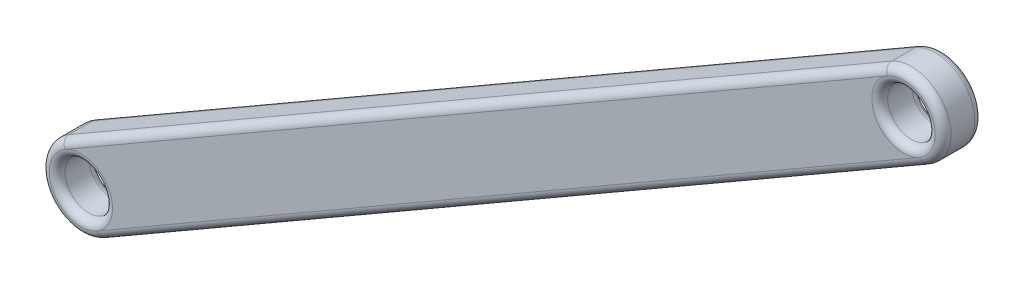
ISO-10303-21;
HEADER;
FILE_DESCRIPTION(('STEP AP214'),'2;1');
FILE_NAME('part.step','',(''),(''),'','','');
FILE_SCHEMA(('AUTOMOTIVE_DESIGN { 1 0 10303 214 1 1 1 1 }'));
ENDSEC;
DATA;
#1=APPLICATION_CONTEXT('core data for automotive mechanical design processes');
#2=APPLICATION_PROTOCOL_DEFINITION('international standard','automotive_design',2000,#1);
#3=PRODUCT_CONTEXT('',#1,'mechanical');
#4=PRODUCT('Part','Part','',(#3));
#5=PRODUCT_RELATED_PRODUCT_CATEGORY('part','',(#4));
#6=PRODUCT_DEFINITION_FORMATION('','',#4);
#7=PRODUCT_DEFINITION_CONTEXT('part definition',#1,'design');
#8=PRODUCT_DEFINITION('design','',#6,#7);
#9=PRODUCT_DEFINITION_SHAPE('','',#8);
#10=(LENGTH_UNIT() NAMED_UNIT(*) SI_UNIT(.MILLI.,.METRE.));
#11=(NAMED_UNIT(*) PLANE_ANGLE_UNIT() SI_UNIT($,.RADIAN.));
#12=(NAMED_UNIT(*) SI_UNIT($,.STERADIAN.) SOLID_ANGLE_UNIT());
#13=UNCERTAINTY_MEASURE_WITH_UNIT(LENGTH_MEASURE(1.E-05),#10,'distance_accuracy_value','');
#14=(GEOMETRIC_REPRESENTATION_CONTEXT(3) GLOBAL_UNCERTAINTY_ASSIGNED_CONTEXT((#13)) GLOBAL_UNIT_ASSIGNED_CONTEXT((#10,
#11,#12)) REPRESENTATION_CONTEXT('',''));
#15=CARTESIAN_POINT('',(0.,0.,0.));
#16=DIRECTION('',(0.,0.,1.));
#17=DIRECTION('',(1.,0.,0.));
#18=AXIS2_PLACEMENT_3D('',#15,#16,#17);
#19=CARTESIAN_POINT('',(0.,0.,2.5));
#20=DIRECTION('',(0.,0.,1.));
#21=DIRECTION('',(1.,0.,0.));
#22=AXIS2_PLACEMENT_3D('',#19,#20,#21);
#23=PLANE('',#22);
#24=CARTESIAN_POINT('',(0.,0.,2.5));
#25=DIRECTION('',(0.,0.,1.));
#26=DIRECTION('',(1.,0.,0.));
#27=AXIS2_PLACEMENT_3D('',#24,#25,#26);
#28=CIRCLE('',#27,2.);
#29=CARTESIAN_POINT('',(-1.00000000000001,1.73205080756887,2.5));
#30=VERTEX_POINT('',#29);
#31=CARTESIAN_POINT('',(2.,0.,2.5));
#32=VERTEX_POINT('',#31);
#33=EDGE_CURVE('E50',#30,#32,#28,.F.);
#34=ORIENTED_EDGE('',*,*,#33,.T.);
#35=CARTESIAN_POINT('',(0.,0.,2.5));
#36=DIRECTION('',(0.,0.,1.));
#37=DIRECTION('',(1.,0.,0.));
#38=AXIS2_PLACEMENT_3D('',#35,#36,#37);
#39=CIRCLE('',#38,2.);
#40=CARTESIAN_POINT('',(1.00000000000001,-1.73205080756887,2.5));
#41=VERTEX_POINT('',#40);
#42=EDGE_CURVE('E11',#32,#41,#39,.F.);
#43=ORIENTED_EDGE('',*,*,#42,.T.);
#44=DIRECTION('',(0.866025403784436,0.500000000000004,0.));
#45=VECTOR('',#44,1.);
#46=CARTESIAN_POINT('',(52.9615242270662,28.2679491924314,2.5));
#47=LINE('',#46,#45);
#48=CARTESIAN_POINT('',(52.9615242270662,28.2679491924314,2.5));
#49=VERTEX_POINT('',#48);
#50=EDGE_CURVE('E181',#41,#49,#47,.T.);
#51=ORIENTED_EDGE('',*,*,#50,.T.);
#52=CARTESIAN_POINT('',(51.9615242270662,30.0000000000003,2.5));
#53=DIRECTION('',(0.,0.,1.));
#54=DIRECTION('',(1.,0.,0.));
#55=AXIS2_PLACEMENT_3D('',#52,#53,#54);
#56=CIRCLE('',#55,2.00000000000001);
#57=CARTESIAN_POINT('',(50.9615242270661,31.7320508075691,2.5));
#58=VERTEX_POINT('',#57);
#59=EDGE_CURVE('E179',#49,#58,#56,.F.);
#60=ORIENTED_EDGE('',*,*,#59,.T.);
#61=DIRECTION('',(-0.866025403784436,-0.500000000000004,0.));
#62=VECTOR('',#61,1.);
#63=CARTESIAN_POINT('',(-1.00000000000001,1.73205080756887,2.5));
#64=LINE('',#63,#62);
#65=EDGE_CURVE('E61',#58,#30,#64,.T.);
#66=ORIENTED_EDGE('',*,*,#65,.T.);
#67=EDGE_LOOP('',(#34,#43,#51,#60,#66));
#68=FACE_BOUND('',#67,.T.);
#69=ADVANCED_FACE('F41',(#68),#23,.T.);
#70=CARTESIAN_POINT('',(0.,0.,0.));
#71=DIRECTION('',(0.,0.,1.));
#72=DIRECTION('',(1.,0.,0.));
#73=AXIS2_PLACEMENT_3D('',#70,#71,#72);
#74=PLANE('',#73);
#75=DIRECTION('',(0.866025403784436,0.500000000000004,0.));
#76=VECTOR('',#75,1.);
#77=CARTESIAN_POINT('',(1.00000000000001,-1.73205080756887,0.));
#78=LINE('',#77,#76);
#79=CARTESIAN_POINT('',(52.9615242270662,28.2679491924314,0.));
#80=VERTEX_POINT('',#79);
#81=CARTESIAN_POINT('',(1.00000000000001,-1.73205080756887,0.));
#82=VERTEX_POINT('',#81);
#83=EDGE_CURVE('E144',#80,#82,#78,.F.);
#84=ORIENTED_EDGE('',*,*,#83,.T.);
#85=CARTESIAN_POINT('',(0.,0.,0.));
#86=DIRECTION('',(0.,0.,1.));
#87=DIRECTION('',(1.,0.,0.));
#88=AXIS2_PLACEMENT_3D('',#85,#86,#87);
#89=CIRCLE('',#88,2.);
#90=CARTESIAN_POINT('',(2.,0.,0.));
#91=VERTEX_POINT('',#90);
#92=EDGE_CURVE('E118',#82,#91,#89,.T.);
#93=ORIENTED_EDGE('',*,*,#92,.T.);
#94=CARTESIAN_POINT('',(0.,0.,0.));
#95=DIRECTION('',(0.,0.,1.));
#96=DIRECTION('',(1.,0.,0.));
#97=AXIS2_PLACEMENT_3D('',#94,#95,#96);
#98=CIRCLE('',#97,2.);
#99=CARTESIAN_POINT('',(-1.00000000000001,1.73205080756888,0.));
#100=VERTEX_POINT('',#99);
#101=EDGE_CURVE('E117',#91,#100,#98,.T.);
#102=ORIENTED_EDGE('',*,*,#101,.T.);
#103=DIRECTION('',(-0.866025403784436,-0.500000000000004,0.));
#104=VECTOR('',#103,1.);
#105=CARTESIAN_POINT('',(-1.00000000000001,1.73205080756888,0.));
#106=LINE('',#105,#104);
#107=CARTESIAN_POINT('',(50.9615242270661,31.7320508075691,0.));
#108=VERTEX_POINT('',#107);
#109=EDGE_CURVE('E134',#100,#108,#106,.F.);
#110=ORIENTED_EDGE('',*,*,#109,.T.);
#111=CARTESIAN_POINT('',(51.9615242270662,30.0000000000003,0.));
#112=DIRECTION('',(0.,0.,1.));
#113=DIRECTION('',(1.,0.,0.));
#114=AXIS2_PLACEMENT_3D('',#111,#112,#113);
#115=CIRCLE('',#114,2.00000000000001);
#116=EDGE_CURVE('E140',#108,#80,#115,.T.);
#117=ORIENTED_EDGE('',*,*,#116,.T.);
#118=EDGE_LOOP('',(#84,#93,#102,#110,#117));
#119=FACE_BOUND('',#118,.T.);
#120=ADVANCED_FACE('F143',(#119),#74,.F.);
#121=CARTESIAN_POINT('',(0.,0.,2.5));
#122=DIRECTION('',(0.,0.,-1.));
#123=DIRECTION('',(-1.,0.,0.));
#124=AXIS2_PLACEMENT_3D('',#121,#122,#123);
#125=CYLINDRICAL_SURFACE('',#124,2.5);
#126=DIRECTION('',(0.,0.,-1.));
#127=VECTOR('',#126,1.);
#128=CARTESIAN_POINT('',(-1.25000000000001,2.16506350946109,2.5));
#129=LINE('',#128,#127);
#130=CARTESIAN_POINT('',(-1.25000000000001,2.16506350946109,2.));
#131=VERTEX_POINT('',#130);
#132=CARTESIAN_POINT('',(-1.25000000000001,2.16506350946109,0.5));
#133=VERTEX_POINT('',#132);
#134=EDGE_CURVE('E191',#131,#133,#129,.T.);
#135=ORIENTED_EDGE('',*,*,#134,.T.);
#136=CARTESIAN_POINT('',(0.,0.,0.5));
#137=DIRECTION('',(0.,0.,1.));
#138=DIRECTION('',(1.,0.,0.));
#139=AXIS2_PLACEMENT_3D('',#136,#137,#138);
#140=CIRCLE('',#139,2.5);
#141=CARTESIAN_POINT('',(1.25000000000001,-2.16506350946109,0.5));
#142=VERTEX_POINT('',#141);
#143=EDGE_CURVE('E128',#133,#142,#140,.T.);
#144=ORIENTED_EDGE('',*,*,#143,.T.);
#145=DIRECTION('',(0.,0.,-1.));
#146=VECTOR('',#145,1.);
#147=CARTESIAN_POINT('',(1.25000000000001,-2.16506350946109,2.5));
#148=LINE('',#147,#146);
#149=CARTESIAN_POINT('',(1.25000000000001,-2.16506350946109,2.));
#150=VERTEX_POINT('',#149);
#151=EDGE_CURVE('E141',#150,#142,#148,.T.);
#152=ORIENTED_EDGE('',*,*,#151,.F.);
#153=CARTESIAN_POINT('',(0.,0.,2.));
#154=DIRECTION('',(0.,0.,1.));
#155=DIRECTION('',(1.,0.,0.));
#156=AXIS2_PLACEMENT_3D('',#153,#154,#155);
#157=CIRCLE('',#156,2.5);
#158=EDGE_CURVE('E176',#150,#131,#157,.F.);
#159=ORIENTED_EDGE('',*,*,#158,.T.);
#160=EDGE_LOOP('',(#135,#144,#152,#159));
#161=FACE_BOUND('',#160,.T.);
#162=ADVANCED_FACE('F225',(#161),#125,.T.);
#163=CARTESIAN_POINT('',(1.25000000000001,-2.16506350946109,2.5));
#164=DIRECTION('',(-0.500000000000004,0.866025403784436,0.));
#165=DIRECTION('',(-0.866025403784436,-0.500000000000004,0.));
#166=AXIS2_PLACEMENT_3D('',#163,#164,#165);
#167=PLANE('',#166);
#168=ORIENTED_EDGE('',*,*,#151,.T.);
#169=DIRECTION('',(0.866025403784436,0.500000000000004,0.));
#170=VECTOR('',#169,1.);
#171=CARTESIAN_POINT('',(1.25000000000001,-2.16506350946109,0.5));
#172=LINE('',#171,#170);
#173=CARTESIAN_POINT('',(53.2115242270662,27.8349364905391,0.5));
#174=VERTEX_POINT('',#173);
#175=EDGE_CURVE('E164',#142,#174,#172,.T.);
#176=ORIENTED_EDGE('',*,*,#175,.T.);
#177=DIRECTION('',(0.,0.,-1.));
#178=VECTOR('',#177,1.);
#179=CARTESIAN_POINT('',(53.2115242270662,27.8349364905391,2.5));
#180=LINE('',#179,#178);
#181=CARTESIAN_POINT('',(53.2115242270662,27.8349364905391,2.));
#182=VERTEX_POINT('',#181);
#183=EDGE_CURVE('E240',#182,#174,#180,.T.);
#184=ORIENTED_EDGE('',*,*,#183,.F.);
#185=DIRECTION('',(0.866025403784436,0.500000000000004,0.));
#186=VECTOR('',#185,1.);
#187=CARTESIAN_POINT('',(1.25000000000001,-2.16506350946109,2.));
#188=LINE('',#187,#186);
#189=EDGE_CURVE('E162',#182,#150,#188,.F.);
#190=ORIENTED_EDGE('',*,*,#189,.T.);
#191=EDGE_LOOP('',(#168,#176,#184,#190));
#192=FACE_BOUND('',#191,.T.);
#193=ADVANCED_FACE('F242',(#192),#167,.F.);
#194=CARTESIAN_POINT('',(51.9615242270662,30.0000000000002,2.5));
#195=DIRECTION('',(0.,0.,-1.));
#196=DIRECTION('',(-1.,0.,0.));
#197=AXIS2_PLACEMENT_3D('',#194,#195,#196);
#198=CYLINDRICAL_SURFACE('',#197,2.5);
#199=ORIENTED_EDGE('',*,*,#183,.T.);
#200=CARTESIAN_POINT('',(51.9615242270662,30.0000000000002,0.5));
#201=DIRECTION('',(0.,0.,1.));
#202=DIRECTION('',(1.,0.,0.));
#203=AXIS2_PLACEMENT_3D('',#200,#201,#202);
#204=CIRCLE('',#203,2.5);
#205=CARTESIAN_POINT('',(50.7115242270661,32.1650635094613,0.5));
#206=VERTEX_POINT('',#205);
#207=EDGE_CURVE('E169',#174,#206,#204,.T.);
#208=ORIENTED_EDGE('',*,*,#207,.T.);
#209=DIRECTION('',(0.,0.,-1.));
#210=VECTOR('',#209,1.);
#211=CARTESIAN_POINT('',(50.7115242270661,32.1650635094613,2.5));
#212=LINE('',#211,#210);
#213=CARTESIAN_POINT('',(50.7115242270661,32.1650635094613,2.));
#214=VERTEX_POINT('',#213);
#215=EDGE_CURVE('E232',#214,#206,#212,.T.);
#216=ORIENTED_EDGE('',*,*,#215,.F.);
#217=CARTESIAN_POINT('',(51.9615242270662,30.0000000000002,2.));
#218=DIRECTION('',(0.,0.,1.));
#219=DIRECTION('',(1.,0.,0.));
#220=AXIS2_PLACEMENT_3D('',#217,#218,#219);
#221=CIRCLE('',#220,2.5);
#222=EDGE_CURVE('E167',#214,#182,#221,.F.);
#223=ORIENTED_EDGE('',*,*,#222,.T.);
#224=EDGE_LOOP('',(#199,#208,#216,#223));
#225=FACE_BOUND('',#224,.T.);
#226=ADVANCED_FACE('F239',(#225),#198,.T.);
#227=CARTESIAN_POINT('',(-1.25000000000001,2.16506350946109,2.5));
#228=DIRECTION('',(0.500000000000004,-0.866025403784436,0.));
#229=DIRECTION('',(0.866025403784436,0.500000000000004,0.));
#230=AXIS2_PLACEMENT_3D('',#227,#228,#229);
#231=PLANE('',#230);
#232=ORIENTED_EDGE('',*,*,#215,.T.);
#233=DIRECTION('',(-0.866025403784436,-0.500000000000004,0.));
#234=VECTOR('',#233,1.);
#235=CARTESIAN_POINT('',(-1.25000000000001,2.16506350946109,0.5));
#236=LINE('',#235,#234);
#237=EDGE_CURVE('E174',#206,#133,#236,.T.);
#238=ORIENTED_EDGE('',*,*,#237,.T.);
#239=ORIENTED_EDGE('',*,*,#134,.F.);
#240=DIRECTION('',(-0.866025403784436,-0.500000000000004,0.));
#241=VECTOR('',#240,1.);
#242=CARTESIAN_POINT('',(50.7115242270662,32.1650635094614,2.));
#243=LINE('',#242,#241);
#244=EDGE_CURVE('E171',#131,#214,#243,.F.);
#245=ORIENTED_EDGE('',*,*,#244,.T.);
#246=EDGE_LOOP('',(#232,#238,#239,#245));
#247=FACE_BOUND('',#246,.T.);
#248=ADVANCED_FACE('F230',(#247),#231,.F.);
#249=CARTESIAN_POINT('',(51.9615242270662,30.0000000000003,2.5));
#250=DIRECTION('',(0.,0.,-1.));
#251=DIRECTION('',(-1.,0.,0.));
#252=AXIS2_PLACEMENT_3D('',#249,#250,#251);
#253=CYLINDRICAL_SURFACE('',#252,1.50000000000001);
#254=CARTESIAN_POINT('',(51.9615242270662,30.0000000000003,0.5));
#255=DIRECTION('',(0.,0.,1.));
#256=DIRECTION('',(1.,0.,0.));
#257=AXIS2_PLACEMENT_3D('',#254,#255,#256);
#258=CIRCLE('',#257,1.50000000000001);
#259=CARTESIAN_POINT('',(53.4615242270662,30.0000000000003,0.5));
#260=VERTEX_POINT('',#259);
#261=EDGE_CURVE('E159',#260,#260,#258,.F.);
#262=ORIENTED_EDGE('',*,*,#261,.T.);
#263=EDGE_LOOP('',(#262));
#264=FACE_BOUND('',#263,.T.);
#265=CARTESIAN_POINT('',(51.9615242270662,30.0000000000003,2.));
#266=DIRECTION('',(0.,0.,1.));
#267=DIRECTION('',(1.,0.,0.));
#268=AXIS2_PLACEMENT_3D('',#265,#266,#267);
#269=CIRCLE('',#268,1.50000000000001);
#270=CARTESIAN_POINT('',(53.4615242270662,30.0000000000003,2.));
#271=VERTEX_POINT('',#270);
#272=EDGE_CURVE('E156',#271,#271,#269,.T.);
#273=ORIENTED_EDGE('',*,*,#272,.T.);
#274=EDGE_LOOP('',(#273));
#275=FACE_BOUND('',#274,.T.);
#276=ADVANCED_FACE('F273',(#264,#275),#253,.F.);
#277=CARTESIAN_POINT('',(0.,0.,2.5));
#278=DIRECTION('',(0.,0.,-1.));
#279=DIRECTION('',(-1.,0.,0.));
#280=AXIS2_PLACEMENT_3D('',#277,#278,#279);
#281=CYLINDRICAL_SURFACE('',#280,1.5);
#282=CARTESIAN_POINT('',(0.,0.,0.5));
#283=DIRECTION('',(0.,0.,1.));
#284=DIRECTION('',(1.,0.,0.));
#285=AXIS2_PLACEMENT_3D('',#282,#283,#284);
#286=CIRCLE('',#285,1.5);
#287=CARTESIAN_POINT('',(1.5,0.,0.5));
#288=VERTEX_POINT('',#287);
#289=EDGE_CURVE('E153',#288,#288,#286,.F.);
#290=ORIENTED_EDGE('',*,*,#289,.T.);
#291=EDGE_LOOP('',(#290));
#292=FACE_BOUND('',#291,.T.);
#293=CARTESIAN_POINT('',(0.,0.,2.));
#294=DIRECTION('',(0.,0.,1.));
#295=DIRECTION('',(1.,0.,0.));
#296=AXIS2_PLACEMENT_3D('',#293,#294,#295);
#297=CIRCLE('',#296,1.5);
#298=CARTESIAN_POINT('',(1.5,0.,2.));
#299=VERTEX_POINT('',#298);
#300=EDGE_CURVE('E150',#299,#299,#297,.T.);
#301=ORIENTED_EDGE('',*,*,#300,.T.);
#302=EDGE_LOOP('',(#301));
#303=FACE_BOUND('',#302,.T.);
#304=ADVANCED_FACE('F292',(#292,#303),#281,.F.);
#305=CARTESIAN_POINT('',(51.9615242270662,30.0000000000003,0.5));
#306=DIRECTION('',(0.,0.,1.));
#307=DIRECTION('',(1.,0.,0.));
#308=AXIS2_PLACEMENT_3D('',#305,#306,#307);
#309=TOROIDAL_SURFACE('',#308,2.00000000000001,0.5);
#310=ORIENTED_EDGE('',*,*,#261,.F.);
#311=EDGE_LOOP('',(#310));
#312=FACE_BOUND('',#311,.T.);
#313=CARTESIAN_POINT('',(51.9615242270662,30.0000000000003,0.));
#314=DIRECTION('',(0.,0.,1.));
#315=DIRECTION('',(1.,0.,0.));
#316=AXIS2_PLACEMENT_3D('',#313,#314,#315);
#317=CIRCLE('',#316,2.00000000000001);
#318=EDGE_CURVE('E188',#80,#108,#317,.T.);
#319=ORIENTED_EDGE('',*,*,#318,.F.);
#320=ORIENTED_EDGE('',*,*,#116,.F.);
#321=EDGE_LOOP('',(#319,#320));
#322=FACE_BOUND('',#321,.T.);
#323=ADVANCED_FACE('F254',(#312,#322),#309,.T.);
#324=CARTESIAN_POINT('',(51.9615242270662,30.0000000000002,0.5));
#325=DIRECTION('',(0.,0.,1.));
#326=DIRECTION('',(1.,0.,0.));
#327=AXIS2_PLACEMENT_3D('',#324,#325,#326);
#328=TOROIDAL_SURFACE('',#327,2.,0.5);
#329=CARTESIAN_POINT('',(52.9615242270662,28.2679491924314,0.5));
#330=DIRECTION('',(-0.866025403784438,-0.500000000000002,0.));
#331=DIRECTION('',(0.500000000000002,-0.866025403784438,0.));
#332=AXIS2_PLACEMENT_3D('',#329,#330,#331);
#333=CIRCLE('',#332,0.5);
#334=EDGE_CURVE('E131',#80,#174,#333,.T.);
#335=ORIENTED_EDGE('',*,*,#334,.F.);
#336=ORIENTED_EDGE('',*,*,#318,.T.);
#337=CARTESIAN_POINT('',(50.9615242270662,31.7320508075691,0.5));
#338=DIRECTION('',(-0.86602540378444,-0.499999999999999,0.));
#339=DIRECTION('',(0.499999999999999,-0.866025403784439,0.));
#340=AXIS2_PLACEMENT_3D('',#337,#338,#339);
#341=CIRCLE('',#340,0.5);
#342=EDGE_CURVE('E137',#206,#108,#341,.T.);
#343=ORIENTED_EDGE('',*,*,#342,.F.);
#344=ORIENTED_EDGE('',*,*,#207,.F.);
#345=EDGE_LOOP('',(#335,#336,#343,#344));
#346=FACE_BOUND('',#345,.T.);
#347=ADVANCED_FACE('F250',(#346),#328,.T.);
#348=CARTESIAN_POINT('',(-1.00000000000001,1.73205080756887,0.5));
#349=DIRECTION('',(-0.866025403784436,-0.500000000000004,0.));
#350=DIRECTION('',(0.500000000000004,-0.866025403784436,0.));
#351=AXIS2_PLACEMENT_3D('',#348,#349,#350);
#352=CYLINDRICAL_SURFACE('',#351,0.5);
#353=ORIENTED_EDGE('',*,*,#342,.T.);
#354=ORIENTED_EDGE('',*,*,#109,.F.);
#355=CARTESIAN_POINT('',(-1.00000000000001,1.73205080756887,0.5));
#356=DIRECTION('',(-0.866025403784436,-0.500000000000004,0.));
#357=DIRECTION('',(0.500000000000004,-0.866025403784436,0.));
#358=AXIS2_PLACEMENT_3D('',#355,#356,#357);
#359=CIRCLE('',#358,0.5);
#360=EDGE_CURVE('E125',#133,#100,#359,.T.);
#361=ORIENTED_EDGE('',*,*,#360,.F.);
#362=ORIENTED_EDGE('',*,*,#237,.F.);
#363=EDGE_LOOP('',(#353,#354,#361,#362));
#364=FACE_BOUND('',#363,.T.);
#365=ADVANCED_FACE('F135',(#364),#352,.T.);
#366=CARTESIAN_POINT('',(1.00000000000001,-1.73205080756887,0.5));
#367=DIRECTION('',(0.866025403784436,0.500000000000004,0.));
#368=DIRECTION('',(-0.500000000000004,0.866025403784436,0.));
#369=AXIS2_PLACEMENT_3D('',#366,#367,#368);
#370=CYLINDRICAL_SURFACE('',#369,0.5);
#371=ORIENTED_EDGE('',*,*,#334,.T.);
#372=ORIENTED_EDGE('',*,*,#175,.F.);
#373=CARTESIAN_POINT('',(1.00000000000001,-1.73205080756887,0.5));
#374=DIRECTION('',(-0.866025403784436,-0.500000000000004,0.));
#375=DIRECTION('',(0.500000000000004,-0.866025403784436,0.));
#376=AXIS2_PLACEMENT_3D('',#373,#374,#375);
#377=CIRCLE('',#376,0.5);
#378=EDGE_CURVE('E121',#82,#142,#377,.T.);
#379=ORIENTED_EDGE('',*,*,#378,.F.);
#380=ORIENTED_EDGE('',*,*,#83,.F.);
#381=EDGE_LOOP('',(#371,#372,#379,#380));
#382=FACE_BOUND('',#381,.T.);
#383=ADVANCED_FACE('F257',(#382),#370,.T.);
#384=CARTESIAN_POINT('',(0.,0.,0.5));
#385=DIRECTION('',(0.,0.,1.));
#386=DIRECTION('',(1.,0.,0.));
#387=AXIS2_PLACEMENT_3D('',#384,#385,#386);
#388=TOROIDAL_SURFACE('',#387,2.,0.5);
#389=ORIENTED_EDGE('',*,*,#143,.F.);
#390=ORIENTED_EDGE('',*,*,#360,.T.);
#391=CARTESIAN_POINT('',(0.,0.,0.));
#392=DIRECTION('',(0.,0.,1.));
#393=DIRECTION('',(1.,0.,0.));
#394=AXIS2_PLACEMENT_3D('',#391,#392,#393);
#395=CIRCLE('',#394,2.);
#396=EDGE_CURVE('E113',#82,#100,#395,.F.);
#397=ORIENTED_EDGE('',*,*,#396,.F.);
#398=ORIENTED_EDGE('',*,*,#378,.T.);
#399=EDGE_LOOP('',(#389,#390,#397,#398));
#400=FACE_BOUND('',#399,.T.);
#401=ADVANCED_FACE('F127',(#400),#388,.T.);
#402=CARTESIAN_POINT('',(0.,0.,0.5));
#403=DIRECTION('',(0.,0.,1.));
#404=DIRECTION('',(1.,0.,0.));
#405=AXIS2_PLACEMENT_3D('',#402,#403,#404);
#406=TOROIDAL_SURFACE('',#405,2.,0.5);
#407=ORIENTED_EDGE('',*,*,#289,.F.);
#408=EDGE_LOOP('',(#407));
#409=FACE_BOUND('',#408,.T.);
#410=ORIENTED_EDGE('',*,*,#396,.T.);
#411=ORIENTED_EDGE('',*,*,#101,.F.);
#412=ORIENTED_EDGE('',*,*,#92,.F.);
#413=EDGE_LOOP('',(#410,#411,#412));
#414=FACE_BOUND('',#413,.T.);
#415=ADVANCED_FACE('F115',(#409,#414),#406,.T.);
#416=CARTESIAN_POINT('',(51.9615242270662,30.0000000000003,2.));
#417=DIRECTION('',(0.,0.,1.));
#418=DIRECTION('',(1.,0.,0.));
#419=AXIS2_PLACEMENT_3D('',#416,#417,#418);
#420=TOROIDAL_SURFACE('',#419,2.00000000000001,0.5);
#421=ORIENTED_EDGE('',*,*,#272,.F.);
#422=EDGE_LOOP('',(#421));
#423=FACE_BOUND('',#422,.T.);
#424=CARTESIAN_POINT('',(51.9615242270662,30.0000000000003,2.5));
#425=DIRECTION('',(0.,0.,1.));
#426=DIRECTION('',(1.,0.,0.));
#427=AXIS2_PLACEMENT_3D('',#424,#425,#426);
#428=CIRCLE('',#427,2.00000000000001);
#429=EDGE_CURVE('E45',#58,#49,#428,.F.);
#430=ORIENTED_EDGE('',*,*,#429,.F.);
#431=ORIENTED_EDGE('',*,*,#59,.F.);
#432=EDGE_LOOP('',(#430,#431));
#433=FACE_BOUND('',#432,.T.);
#434=ADVANCED_FACE('F43',(#423,#433),#420,.T.);
#435=CARTESIAN_POINT('',(51.9615242270662,30.0000000000002,2.));
#436=DIRECTION('',(0.,0.,1.));
#437=DIRECTION('',(1.,0.,0.));
#438=AXIS2_PLACEMENT_3D('',#435,#436,#437);
#439=TOROIDAL_SURFACE('',#438,2.,0.5);
#440=CARTESIAN_POINT('',(50.9615242270661,31.7320508075691,2.));
#441=DIRECTION('',(-0.866025403784442,-0.499999999999994,0.));
#442=DIRECTION('',(0.499999999999994,-0.866025403784442,0.));
#443=AXIS2_PLACEMENT_3D('',#440,#441,#442);
#444=CIRCLE('',#443,0.5);
#445=EDGE_CURVE('E200',#58,#214,#444,.T.);
#446=ORIENTED_EDGE('',*,*,#445,.F.);
#447=ORIENTED_EDGE('',*,*,#429,.T.);
#448=CARTESIAN_POINT('',(52.9615242270662,28.2679491924314,2.));
#449=DIRECTION('',(-0.866025403784438,-0.500000000000002,0.));
#450=DIRECTION('',(0.500000000000002,-0.866025403784438,0.));
#451=AXIS2_PLACEMENT_3D('',#448,#449,#450);
#452=CIRCLE('',#451,0.5);
#453=EDGE_CURVE('E201',#182,#49,#452,.T.);
#454=ORIENTED_EDGE('',*,*,#453,.F.);
#455=ORIENTED_EDGE('',*,*,#222,.F.);
#456=EDGE_LOOP('',(#446,#447,#454,#455));
#457=FACE_BOUND('',#456,.T.);
#458=ADVANCED_FACE('F211',(#457),#439,.T.);
#459=CARTESIAN_POINT('',(1.00000000000001,-1.73205080756887,2.));
#460=DIRECTION('',(-0.866025403784436,-0.500000000000004,0.));
#461=DIRECTION('',(0.500000000000004,-0.866025403784436,0.));
#462=AXIS2_PLACEMENT_3D('',#459,#460,#461);
#463=CYLINDRICAL_SURFACE('',#462,0.5);
#464=ORIENTED_EDGE('',*,*,#453,.T.);
#465=ORIENTED_EDGE('',*,*,#50,.F.);
#466=CARTESIAN_POINT('',(1.00000000000001,-1.73205080756887,2.));
#467=DIRECTION('',(-0.866025403784436,-0.500000000000004,0.));
#468=DIRECTION('',(0.500000000000004,-0.866025403784436,0.));
#469=AXIS2_PLACEMENT_3D('',#466,#467,#468);
#470=CIRCLE('',#469,0.5);
#471=EDGE_CURVE('E197',#150,#41,#470,.T.);
#472=ORIENTED_EDGE('',*,*,#471,.F.);
#473=ORIENTED_EDGE('',*,*,#189,.F.);
#474=EDGE_LOOP('',(#464,#465,#472,#473));
#475=FACE_BOUND('',#474,.T.);
#476=ADVANCED_FACE('F216',(#475),#463,.T.);
#477=CARTESIAN_POINT('',(-1.00000000000001,1.73205080756887,2.));
#478=DIRECTION('',(0.866025403784436,0.500000000000004,0.));
#479=DIRECTION('',(-0.500000000000004,0.866025403784436,0.));
#480=AXIS2_PLACEMENT_3D('',#477,#478,#479);
#481=CYLINDRICAL_SURFACE('',#480,0.5);
#482=ORIENTED_EDGE('',*,*,#445,.T.);
#483=ORIENTED_EDGE('',*,*,#244,.F.);
#484=CARTESIAN_POINT('',(-1.00000000000001,1.73205080756887,2.));
#485=DIRECTION('',(-0.866025403784436,-0.500000000000004,0.));
#486=DIRECTION('',(0.500000000000004,-0.866025403784436,0.));
#487=AXIS2_PLACEMENT_3D('',#484,#485,#486);
#488=CIRCLE('',#487,0.5);
#489=EDGE_CURVE('E194',#30,#131,#488,.T.);
#490=ORIENTED_EDGE('',*,*,#489,.F.);
#491=ORIENTED_EDGE('',*,*,#65,.F.);
#492=EDGE_LOOP('',(#482,#483,#490,#491));
#493=FACE_BOUND('',#492,.T.);
#494=ADVANCED_FACE('F235',(#493),#481,.T.);
#495=CARTESIAN_POINT('',(0.,0.,2.));
#496=DIRECTION('',(0.,0.,1.));
#497=DIRECTION('',(1.,0.,0.));
#498=AXIS2_PLACEMENT_3D('',#495,#496,#497);
#499=TOROIDAL_SURFACE('',#498,2.,0.5);
#500=ORIENTED_EDGE('',*,*,#158,.F.);
#501=ORIENTED_EDGE('',*,*,#471,.T.);
#502=CARTESIAN_POINT('',(0.,0.,2.5));
#503=DIRECTION('',(0.,0.,1.));
#504=DIRECTION('',(1.,0.,0.));
#505=AXIS2_PLACEMENT_3D('',#502,#503,#504);
#506=CIRCLE('',#505,2.);
#507=EDGE_CURVE('E192',#30,#41,#506,.T.);
#508=ORIENTED_EDGE('',*,*,#507,.F.);
#509=ORIENTED_EDGE('',*,*,#489,.T.);
#510=EDGE_LOOP('',(#500,#501,#508,#509));
#511=FACE_BOUND('',#510,.T.);
#512=ADVANCED_FACE('F220',(#511),#499,.T.);
#513=CARTESIAN_POINT('',(0.,0.,2.));
#514=DIRECTION('',(0.,0.,1.));
#515=DIRECTION('',(1.,0.,0.));
#516=AXIS2_PLACEMENT_3D('',#513,#514,#515);
#517=TOROIDAL_SURFACE('',#516,2.,0.5);
#518=ORIENTED_EDGE('',*,*,#507,.T.);
#519=ORIENTED_EDGE('',*,*,#42,.F.);
#520=ORIENTED_EDGE('',*,*,#33,.F.);
#521=EDGE_LOOP('',(#518,#519,#520));
#522=FACE_BOUND('',#521,.T.);
#523=ORIENTED_EDGE('',*,*,#300,.F.);
#524=EDGE_LOOP('',(#523));
#525=FACE_BOUND('',#524,.T.);
#526=ADVANCED_FACE('F297',(#522,#525),#517,.T.);
#527=CLOSED_SHELL('',(#69,#120,#162,#193,#226,#248,#276,#304,#323,#347,#365,#383,#401,#415,#434,
#458,#476,#494,#512,#526));
#528=MANIFOLD_SOLID_BREP('B2',#527);
#529=ADVANCED_BREP_SHAPE_REPRESENTATION('',(#18,#528),#14);
#530=SHAPE_DEFINITION_REPRESENTATION(#9,#529);
ENDSEC;
END-ISO-10303-21;
